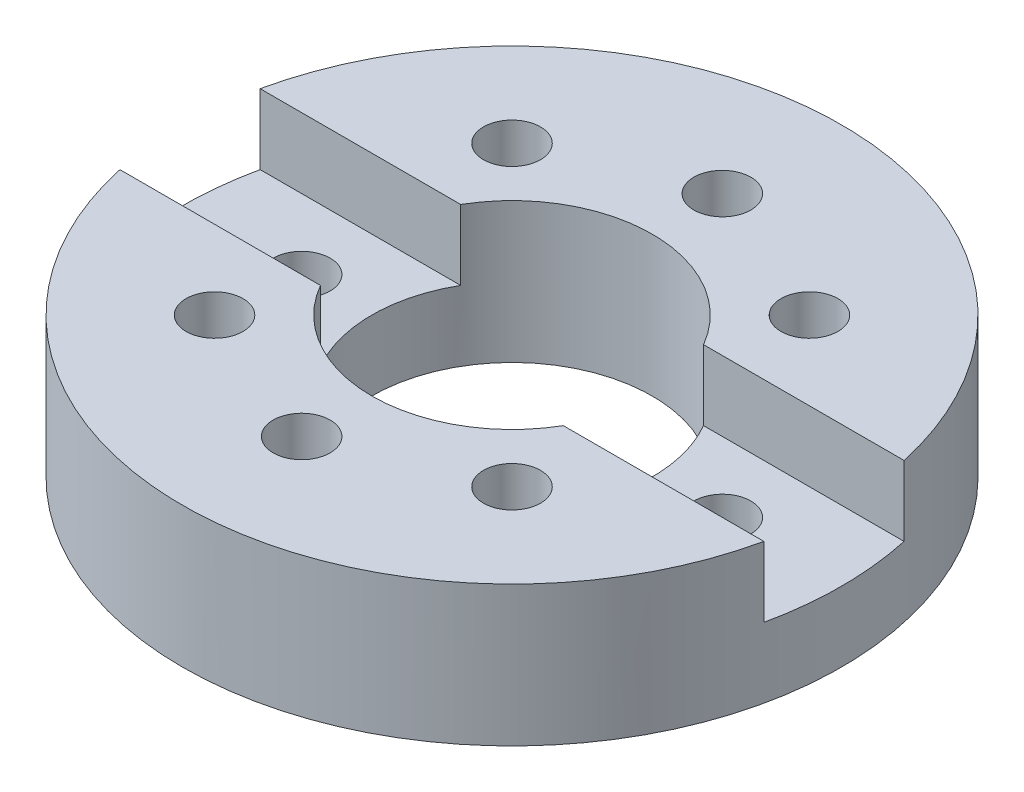
ISO-10303-21;
HEADER;
FILE_DESCRIPTION(('STEP AP214'),'2;1');
FILE_NAME('part.step','',(''),(''),'','','');
FILE_SCHEMA(('AUTOMOTIVE_DESIGN { 1 0 10303 214 1 1 1 1 }'));
ENDSEC;
DATA;
#1=APPLICATION_CONTEXT('core data for automotive mechanical design processes');
#2=APPLICATION_PROTOCOL_DEFINITION('international standard','automotive_design',2000,#1);
#3=PRODUCT_CONTEXT('',#1,'mechanical');
#4=PRODUCT('Part','Part','',(#3));
#5=PRODUCT_RELATED_PRODUCT_CATEGORY('part','',(#4));
#6=PRODUCT_DEFINITION_FORMATION('','',#4);
#7=PRODUCT_DEFINITION_CONTEXT('part definition',#1,'design');
#8=PRODUCT_DEFINITION('design','',#6,#7);
#9=PRODUCT_DEFINITION_SHAPE('','',#8);
#10=(LENGTH_UNIT() NAMED_UNIT(*) SI_UNIT(.MILLI.,.METRE.));
#11=(NAMED_UNIT(*) PLANE_ANGLE_UNIT() SI_UNIT($,.RADIAN.));
#12=(NAMED_UNIT(*) SI_UNIT($,.STERADIAN.) SOLID_ANGLE_UNIT());
#13=UNCERTAINTY_MEASURE_WITH_UNIT(LENGTH_MEASURE(1.E-05),#10,'distance_accuracy_value','');
#14=(GEOMETRIC_REPRESENTATION_CONTEXT(3) GLOBAL_UNCERTAINTY_ASSIGNED_CONTEXT((#13)) GLOBAL_UNIT_ASSIGNED_CONTEXT((#10,
#11,#12)) REPRESENTATION_CONTEXT('',''));
#15=CARTESIAN_POINT('',(0.,0.,0.));
#16=DIRECTION('',(0.,0.,1.));
#17=DIRECTION('',(1.,0.,0.));
#18=AXIS2_PLACEMENT_3D('',#15,#16,#17);
#19=CARTESIAN_POINT('',(0.,1.,0.));
#20=DIRECTION('',(0.,1.,0.));
#21=DIRECTION('',(0.,0.,1.));
#22=AXIS2_PLACEMENT_3D('',#19,#20,#21);
#23=PLANE('',#22);
#24=DIRECTION('',(-1.,0.,0.));
#25=VECTOR('',#24,1.);
#26=CARTESIAN_POINT('',(-2.35,1.,-0.5));
#27=LINE('',#26,#25);
#28=CARTESIAN_POINT('',(2.29619250064101,1.,-0.5));
#29=VERTEX_POINT('',#28);
#30=CARTESIAN_POINT('',(0.866025403784439,1.,-0.5));
#31=VERTEX_POINT('',#30);
#32=EDGE_CURVE('E217',#29,#31,#27,.T.);
#33=ORIENTED_EDGE('',*,*,#32,.F.);
#34=CARTESIAN_POINT('',(0.,1.,0.));
#35=DIRECTION('',(0.,1.,0.));
#36=DIRECTION('',(0.,0.,1.));
#37=AXIS2_PLACEMENT_3D('',#34,#35,#36);
#38=CIRCLE('',#37,2.35);
#39=CARTESIAN_POINT('',(-2.29619250064101,1.,-0.5));
#40=VERTEX_POINT('',#39);
#41=EDGE_CURVE('E189',#29,#40,#38,.T.);
#42=ORIENTED_EDGE('',*,*,#41,.T.);
#43=CARTESIAN_POINT('',(-0.866025403784439,1.,-0.5));
#44=VERTEX_POINT('',#43);
#45=EDGE_CURVE('E106',#44,#40,#27,.T.);
#46=ORIENTED_EDGE('',*,*,#45,.F.);
#47=CARTESIAN_POINT('',(0.,1.,0.));
#48=DIRECTION('',(0.,1.,0.));
#49=DIRECTION('',(0.,0.,1.));
#50=AXIS2_PLACEMENT_3D('',#47,#48,#49);
#51=CIRCLE('',#50,1.);
#52=EDGE_CURVE('E141',#31,#44,#51,.T.);
#53=ORIENTED_EDGE('',*,*,#52,.F.);
#54=EDGE_LOOP('',(#33,#42,#46,#53));
#55=FACE_BOUND('',#54,.T.);
#56=CARTESIAN_POINT('',(-1.06066017177982,1.,-1.06066017177982));
#57=DIRECTION('',(0.,1.,0.));
#58=DIRECTION('',(0.,0.,1.));
#59=AXIS2_PLACEMENT_3D('',#56,#57,#58);
#60=CIRCLE('',#59,0.2032);
#61=CARTESIAN_POINT('',(-1.06066017177982,1.,-0.857460171779821));
#62=VERTEX_POINT('',#61);
#63=EDGE_CURVE('E144',#62,#62,#60,.T.);
#64=ORIENTED_EDGE('',*,*,#63,.F.);
#65=EDGE_LOOP('',(#64));
#66=FACE_BOUND('',#65,.T.);
#67=CARTESIAN_POINT('',(1.06066017177982,1.,-1.06066017177982));
#68=DIRECTION('',(0.,1.,0.));
#69=DIRECTION('',(0.,0.,1.));
#70=AXIS2_PLACEMENT_3D('',#67,#68,#69);
#71=CIRCLE('',#70,0.2032);
#72=CARTESIAN_POINT('',(1.06066017177982,1.,-0.857460171779821));
#73=VERTEX_POINT('',#72);
#74=EDGE_CURVE('E174',#73,#73,#71,.T.);
#75=ORIENTED_EDGE('',*,*,#74,.F.);
#76=EDGE_LOOP('',(#75));
#77=FACE_BOUND('',#76,.T.);
#78=CARTESIAN_POINT('',(0.,1.,-1.5));
#79=DIRECTION('',(0.,1.,0.));
#80=DIRECTION('',(0.,0.,1.));
#81=AXIS2_PLACEMENT_3D('',#78,#79,#80);
#82=CIRCLE('',#81,0.2032);
#83=CARTESIAN_POINT('',(0.,1.,-1.2968));
#84=VERTEX_POINT('',#83);
#85=EDGE_CURVE('E180',#84,#84,#82,.T.);
#86=ORIENTED_EDGE('',*,*,#85,.F.);
#87=EDGE_LOOP('',(#86));
#88=FACE_BOUND('',#87,.T.);
#89=ADVANCED_FACE('F36',(#55,#66,#77,#88),#23,.T.);
#90=CARTESIAN_POINT('',(1.5,1.,0.));
#91=DIRECTION('',(0.,-1.,0.));
#92=DIRECTION('',(0.,0.,-1.));
#93=AXIS2_PLACEMENT_3D('',#90,#91,#92);
#94=CYLINDRICAL_SURFACE('',#93,0.2032);
#95=CARTESIAN_POINT('',(1.5,0.,0.));
#96=DIRECTION('',(0.,1.,0.));
#97=DIRECTION('',(0.,0.,1.));
#98=AXIS2_PLACEMENT_3D('',#95,#96,#97);
#99=CIRCLE('',#98,0.2032);
#100=CARTESIAN_POINT('',(1.5,0.,0.2032));
#101=VERTEX_POINT('',#100);
#102=EDGE_CURVE('E168',#101,#101,#99,.T.);
#103=ORIENTED_EDGE('',*,*,#102,.F.);
#104=EDGE_LOOP('',(#103));
#105=FACE_BOUND('',#104,.T.);
#106=CARTESIAN_POINT('',(1.5,0.5,0.));
#107=DIRECTION('',(0.,1.,0.));
#108=DIRECTION('',(0.,0.,1.));
#109=AXIS2_PLACEMENT_3D('',#106,#107,#108);
#110=CIRCLE('',#109,0.2032);
#111=CARTESIAN_POINT('',(1.5,0.5,0.2032));
#112=VERTEX_POINT('',#111);
#113=EDGE_CURVE('E123',#112,#112,#110,.T.);
#114=ORIENTED_EDGE('',*,*,#113,.T.);
#115=EDGE_LOOP('',(#114));
#116=FACE_BOUND('',#115,.T.);
#117=ADVANCED_FACE('F246',(#105,#116),#94,.F.);
#118=CARTESIAN_POINT('',(-1.5,1.,0.));
#119=DIRECTION('',(0.,-1.,0.));
#120=DIRECTION('',(0.,0.,-1.));
#121=AXIS2_PLACEMENT_3D('',#118,#119,#120);
#122=CYLINDRICAL_SURFACE('',#121,0.2032);
#123=CARTESIAN_POINT('',(-1.5,0.,0.));
#124=DIRECTION('',(0.,1.,0.));
#125=DIRECTION('',(0.,0.,1.));
#126=AXIS2_PLACEMENT_3D('',#123,#124,#125);
#127=CIRCLE('',#126,0.2032);
#128=CARTESIAN_POINT('',(-1.5,0.,0.2032));
#129=VERTEX_POINT('',#128);
#130=EDGE_CURVE('E147',#129,#129,#127,.T.);
#131=ORIENTED_EDGE('',*,*,#130,.F.);
#132=EDGE_LOOP('',(#131));
#133=FACE_BOUND('',#132,.T.);
#134=CARTESIAN_POINT('',(-1.5,0.5,0.));
#135=DIRECTION('',(0.,1.,0.));
#136=DIRECTION('',(0.,0.,1.));
#137=AXIS2_PLACEMENT_3D('',#134,#135,#136);
#138=CIRCLE('',#137,0.2032);
#139=CARTESIAN_POINT('',(-1.5,0.5,0.2032));
#140=VERTEX_POINT('',#139);
#141=EDGE_CURVE('E127',#140,#140,#138,.T.);
#142=ORIENTED_EDGE('',*,*,#141,.T.);
#143=EDGE_LOOP('',(#142));
#144=FACE_BOUND('',#143,.T.);
#145=ADVANCED_FACE('F252',(#133,#144),#122,.F.);
#146=DIRECTION('',(1.,0.,0.));
#147=VECTOR('',#146,1.);
#148=CARTESIAN_POINT('',(-2.35,1.,0.5));
#149=LINE('',#148,#147);
#150=CARTESIAN_POINT('',(-2.29619250064101,1.,0.5));
#151=VERTEX_POINT('',#150);
#152=CARTESIAN_POINT('',(-0.866025403784439,1.,0.5));
#153=VERTEX_POINT('',#152);
#154=EDGE_CURVE('E211',#151,#153,#149,.T.);
#155=ORIENTED_EDGE('',*,*,#154,.F.);
#156=CARTESIAN_POINT('',(2.29619250064101,1.,0.5));
#157=VERTEX_POINT('',#156);
#158=EDGE_CURVE('E186',#151,#157,#38,.T.);
#159=ORIENTED_EDGE('',*,*,#158,.T.);
#160=CARTESIAN_POINT('',(0.866025403784439,1.,0.5));
#161=VERTEX_POINT('',#160);
#162=EDGE_CURVE('E212',#161,#157,#149,.T.);
#163=ORIENTED_EDGE('',*,*,#162,.F.);
#164=EDGE_CURVE('E136',#153,#161,#51,.T.);
#165=ORIENTED_EDGE('',*,*,#164,.F.);
#166=EDGE_LOOP('',(#155,#159,#163,#165));
#167=FACE_BOUND('',#166,.T.);
#168=CARTESIAN_POINT('',(0.,1.,1.5));
#169=DIRECTION('',(0.,1.,0.));
#170=DIRECTION('',(0.,0.,1.));
#171=AXIS2_PLACEMENT_3D('',#168,#169,#170);
#172=CIRCLE('',#171,0.2032);
#173=CARTESIAN_POINT('',(0.,1.,1.7032));
#174=VERTEX_POINT('',#173);
#175=EDGE_CURVE('E159',#174,#174,#172,.T.);
#176=ORIENTED_EDGE('',*,*,#175,.F.);
#177=EDGE_LOOP('',(#176));
#178=FACE_BOUND('',#177,.T.);
#179=CARTESIAN_POINT('',(1.06066017177982,1.,1.06066017177982));
#180=DIRECTION('',(0.,1.,0.));
#181=DIRECTION('',(0.,0.,1.));
#182=AXIS2_PLACEMENT_3D('',#179,#180,#181);
#183=CIRCLE('',#182,0.2032);
#184=CARTESIAN_POINT('',(1.06066017177982,1.,1.26386017177982));
#185=VERTEX_POINT('',#184);
#186=EDGE_CURVE('E165',#185,#185,#183,.T.);
#187=ORIENTED_EDGE('',*,*,#186,.F.);
#188=EDGE_LOOP('',(#187));
#189=FACE_BOUND('',#188,.T.);
#190=CARTESIAN_POINT('',(-1.06066017177982,1.,1.06066017177982));
#191=DIRECTION('',(0.,1.,0.));
#192=DIRECTION('',(0.,0.,1.));
#193=AXIS2_PLACEMENT_3D('',#190,#191,#192);
#194=CIRCLE('',#193,0.2032);
#195=CARTESIAN_POINT('',(-1.06066017177982,1.,1.26386017177982));
#196=VERTEX_POINT('',#195);
#197=EDGE_CURVE('E153',#196,#196,#194,.T.);
#198=ORIENTED_EDGE('',*,*,#197,.F.);
#199=EDGE_LOOP('',(#198));
#200=FACE_BOUND('',#199,.T.);
#201=ADVANCED_FACE('F209',(#167,#178,#189,#200),#23,.T.);
#202=CARTESIAN_POINT('',(0.,0.,0.));
#203=DIRECTION('',(0.,1.,0.));
#204=DIRECTION('',(0.,0.,1.));
#205=AXIS2_PLACEMENT_3D('',#202,#203,#204);
#206=PLANE('',#205);
#207=CARTESIAN_POINT('',(0.,0.,0.));
#208=DIRECTION('',(0.,1.,0.));
#209=DIRECTION('',(0.,0.,1.));
#210=AXIS2_PLACEMENT_3D('',#207,#208,#209);
#211=CIRCLE('',#210,1.);
#212=CARTESIAN_POINT('',(0.,0.,1.));
#213=VERTEX_POINT('',#212);
#214=EDGE_CURVE('E137',#213,#213,#211,.T.);
#215=ORIENTED_EDGE('',*,*,#214,.T.);
#216=EDGE_LOOP('',(#215));
#217=FACE_BOUND('',#216,.T.);
#218=CARTESIAN_POINT('',(0.,0.,0.));
#219=DIRECTION('',(0.,1.,0.));
#220=DIRECTION('',(0.,0.,1.));
#221=AXIS2_PLACEMENT_3D('',#218,#219,#220);
#222=CIRCLE('',#221,2.35);
#223=CARTESIAN_POINT('',(0.,0.,2.35));
#224=VERTEX_POINT('',#223);
#225=EDGE_CURVE('E183',#224,#224,#222,.T.);
#226=ORIENTED_EDGE('',*,*,#225,.F.);
#227=EDGE_LOOP('',(#226));
#228=FACE_BOUND('',#227,.T.);
#229=CARTESIAN_POINT('',(0.,0.,-1.5));
#230=DIRECTION('',(0.,1.,0.));
#231=DIRECTION('',(0.,0.,1.));
#232=AXIS2_PLACEMENT_3D('',#229,#230,#231);
#233=CIRCLE('',#232,0.2032);
#234=CARTESIAN_POINT('',(0.,0.,-1.2968));
#235=VERTEX_POINT('',#234);
#236=EDGE_CURVE('E177',#235,#235,#233,.T.);
#237=ORIENTED_EDGE('',*,*,#236,.T.);
#238=EDGE_LOOP('',(#237));
#239=FACE_BOUND('',#238,.T.);
#240=CARTESIAN_POINT('',(1.06066017177982,0.,-1.06066017177982));
#241=DIRECTION('',(0.,1.,0.));
#242=DIRECTION('',(0.,0.,1.));
#243=AXIS2_PLACEMENT_3D('',#240,#241,#242);
#244=CIRCLE('',#243,0.2032);
#245=CARTESIAN_POINT('',(1.06066017177982,0.,-0.857460171779821));
#246=VERTEX_POINT('',#245);
#247=EDGE_CURVE('E173',#246,#246,#244,.T.);
#248=ORIENTED_EDGE('',*,*,#247,.T.);
#249=EDGE_LOOP('',(#248));
#250=FACE_BOUND('',#249,.T.);
#251=ORIENTED_EDGE('',*,*,#102,.T.);
#252=EDGE_LOOP('',(#251));
#253=FACE_BOUND('',#252,.T.);
#254=CARTESIAN_POINT('',(1.06066017177982,0.,1.06066017177982));
#255=DIRECTION('',(0.,1.,0.));
#256=DIRECTION('',(0.,0.,1.));
#257=AXIS2_PLACEMENT_3D('',#254,#255,#256);
#258=CIRCLE('',#257,0.2032);
#259=CARTESIAN_POINT('',(1.06066017177982,0.,1.26386017177982));
#260=VERTEX_POINT('',#259);
#261=EDGE_CURVE('E162',#260,#260,#258,.T.);
#262=ORIENTED_EDGE('',*,*,#261,.T.);
#263=EDGE_LOOP('',(#262));
#264=FACE_BOUND('',#263,.T.);
#265=CARTESIAN_POINT('',(0.,0.,1.5));
#266=DIRECTION('',(0.,1.,0.));
#267=DIRECTION('',(0.,0.,1.));
#268=AXIS2_PLACEMENT_3D('',#265,#266,#267);
#269=CIRCLE('',#268,0.2032);
#270=CARTESIAN_POINT('',(0.,0.,1.7032));
#271=VERTEX_POINT('',#270);
#272=EDGE_CURVE('E156',#271,#271,#269,.T.);
#273=ORIENTED_EDGE('',*,*,#272,.T.);
#274=EDGE_LOOP('',(#273));
#275=FACE_BOUND('',#274,.T.);
#276=CARTESIAN_POINT('',(-1.06066017177982,0.,1.06066017177982));
#277=DIRECTION('',(0.,1.,0.));
#278=DIRECTION('',(0.,0.,1.));
#279=AXIS2_PLACEMENT_3D('',#276,#277,#278);
#280=CIRCLE('',#279,0.2032);
#281=CARTESIAN_POINT('',(-1.06066017177982,0.,1.26386017177982));
#282=VERTEX_POINT('',#281);
#283=EDGE_CURVE('E152',#282,#282,#280,.T.);
#284=ORIENTED_EDGE('',*,*,#283,.T.);
#285=EDGE_LOOP('',(#284));
#286=FACE_BOUND('',#285,.T.);
#287=ORIENTED_EDGE('',*,*,#130,.T.);
#288=EDGE_LOOP('',(#287));
#289=FACE_BOUND('',#288,.T.);
#290=CARTESIAN_POINT('',(-1.06066017177982,0.,-1.06066017177982));
#291=DIRECTION('',(0.,1.,0.));
#292=DIRECTION('',(0.,0.,1.));
#293=AXIS2_PLACEMENT_3D('',#290,#291,#292);
#294=CIRCLE('',#293,0.2032);
#295=CARTESIAN_POINT('',(-1.06066017177982,0.,-0.857460171779821));
#296=VERTEX_POINT('',#295);
#297=EDGE_CURVE('E140',#296,#296,#294,.T.);
#298=ORIENTED_EDGE('',*,*,#297,.T.);
#299=EDGE_LOOP('',(#298));
#300=FACE_BOUND('',#299,.T.);
#301=ADVANCED_FACE('F259',(#217,#228,#239,#250,#253,#264,#275,#286,#289,#300),#206,.F.);
#302=CARTESIAN_POINT('',(0.,1.,0.));
#303=DIRECTION('',(0.,-1.,0.));
#304=DIRECTION('',(0.,0.,-1.));
#305=AXIS2_PLACEMENT_3D('',#302,#303,#304);
#306=CYLINDRICAL_SURFACE('',#305,2.35);
#307=ORIENTED_EDGE('',*,*,#41,.F.);
#308=DIRECTION('',(0.,-1.,0.));
#309=VECTOR('',#308,1.);
#310=CARTESIAN_POINT('',(2.29619250064101,1.,-0.5));
#311=LINE('',#310,#309);
#312=CARTESIAN_POINT('',(2.29619250064101,0.5,-0.5));
#313=VERTEX_POINT('',#312);
#314=EDGE_CURVE('E111',#29,#313,#311,.T.);
#315=ORIENTED_EDGE('',*,*,#314,.T.);
#316=CARTESIAN_POINT('',(0.,0.5,0.));
#317=DIRECTION('',(0.,1.,0.));
#318=DIRECTION('',(0.,0.,1.));
#319=AXIS2_PLACEMENT_3D('',#316,#317,#318);
#320=CIRCLE('',#319,2.35);
#321=CARTESIAN_POINT('',(2.29619250064101,0.5,0.5));
#322=VERTEX_POINT('',#321);
#323=EDGE_CURVE('E122',#322,#313,#320,.T.);
#324=ORIENTED_EDGE('',*,*,#323,.F.);
#325=DIRECTION('',(0.,-1.,0.));
#326=VECTOR('',#325,1.);
#327=CARTESIAN_POINT('',(2.29619250064101,1.,0.5));
#328=LINE('',#327,#326);
#329=EDGE_CURVE('E125',#322,#157,#328,.F.);
#330=ORIENTED_EDGE('',*,*,#329,.T.);
#331=ORIENTED_EDGE('',*,*,#158,.F.);
#332=DIRECTION('',(0.,-1.,0.));
#333=VECTOR('',#332,1.);
#334=CARTESIAN_POINT('',(-2.29619250064101,1.,0.5));
#335=LINE('',#334,#333);
#336=CARTESIAN_POINT('',(-2.29619250064101,0.5,0.5));
#337=VERTEX_POINT('',#336);
#338=EDGE_CURVE('E112',#151,#337,#335,.T.);
#339=ORIENTED_EDGE('',*,*,#338,.T.);
#340=CARTESIAN_POINT('',(-2.29619250064101,0.5,-0.5));
#341=VERTEX_POINT('',#340);
#342=EDGE_CURVE('E115',#341,#337,#320,.T.);
#343=ORIENTED_EDGE('',*,*,#342,.F.);
#344=DIRECTION('',(0.,-1.,0.));
#345=VECTOR('',#344,1.);
#346=CARTESIAN_POINT('',(-2.29619250064101,1.,-0.5));
#347=LINE('',#346,#345);
#348=EDGE_CURVE('E101',#341,#40,#347,.F.);
#349=ORIENTED_EDGE('',*,*,#348,.T.);
#350=EDGE_LOOP('',(#307,#315,#324,#330,#331,#339,#343,#349));
#351=FACE_BOUND('',#350,.T.);
#352=ORIENTED_EDGE('',*,*,#225,.T.);
#353=EDGE_LOOP('',(#352));
#354=FACE_BOUND('',#353,.T.);
#355=ADVANCED_FACE('F38',(#351,#354),#306,.T.);
#356=CARTESIAN_POINT('',(0.,1.,-1.5));
#357=DIRECTION('',(0.,-1.,0.));
#358=DIRECTION('',(0.,0.,-1.));
#359=AXIS2_PLACEMENT_3D('',#356,#357,#358);
#360=CYLINDRICAL_SURFACE('',#359,0.2032);
#361=ORIENTED_EDGE('',*,*,#85,.T.);
#362=EDGE_LOOP('',(#361));
#363=FACE_BOUND('',#362,.T.);
#364=ORIENTED_EDGE('',*,*,#236,.F.);
#365=EDGE_LOOP('',(#364));
#366=FACE_BOUND('',#365,.T.);
#367=ADVANCED_FACE('F286',(#363,#366),#360,.F.);
#368=CARTESIAN_POINT('',(1.06066017177982,1.,-1.06066017177982));
#369=DIRECTION('',(0.,-1.,0.));
#370=DIRECTION('',(0.,0.,-1.));
#371=AXIS2_PLACEMENT_3D('',#368,#369,#370);
#372=CYLINDRICAL_SURFACE('',#371,0.2032);
#373=ORIENTED_EDGE('',*,*,#74,.T.);
#374=EDGE_LOOP('',(#373));
#375=FACE_BOUND('',#374,.T.);
#376=ORIENTED_EDGE('',*,*,#247,.F.);
#377=EDGE_LOOP('',(#376));
#378=FACE_BOUND('',#377,.T.);
#379=ADVANCED_FACE('F282',(#375,#378),#372,.F.);
#380=CARTESIAN_POINT('',(1.06066017177982,1.,1.06066017177982));
#381=DIRECTION('',(0.,-1.,0.));
#382=DIRECTION('',(0.,0.,-1.));
#383=AXIS2_PLACEMENT_3D('',#380,#381,#382);
#384=CYLINDRICAL_SURFACE('',#383,0.2032);
#385=ORIENTED_EDGE('',*,*,#186,.T.);
#386=EDGE_LOOP('',(#385));
#387=FACE_BOUND('',#386,.T.);
#388=ORIENTED_EDGE('',*,*,#261,.F.);
#389=EDGE_LOOP('',(#388));
#390=FACE_BOUND('',#389,.T.);
#391=ADVANCED_FACE('F279',(#387,#390),#384,.F.);
#392=CARTESIAN_POINT('',(0.,1.,1.5));
#393=DIRECTION('',(0.,-1.,0.));
#394=DIRECTION('',(0.,0.,-1.));
#395=AXIS2_PLACEMENT_3D('',#392,#393,#394);
#396=CYLINDRICAL_SURFACE('',#395,0.2032);
#397=ORIENTED_EDGE('',*,*,#175,.T.);
#398=EDGE_LOOP('',(#397));
#399=FACE_BOUND('',#398,.T.);
#400=ORIENTED_EDGE('',*,*,#272,.F.);
#401=EDGE_LOOP('',(#400));
#402=FACE_BOUND('',#401,.T.);
#403=ADVANCED_FACE('F275',(#399,#402),#396,.F.);
#404=CARTESIAN_POINT('',(-1.06066017177982,1.,1.06066017177982));
#405=DIRECTION('',(0.,-1.,0.));
#406=DIRECTION('',(0.,0.,-1.));
#407=AXIS2_PLACEMENT_3D('',#404,#405,#406);
#408=CYLINDRICAL_SURFACE('',#407,0.2032);
#409=ORIENTED_EDGE('',*,*,#197,.T.);
#410=EDGE_LOOP('',(#409));
#411=FACE_BOUND('',#410,.T.);
#412=ORIENTED_EDGE('',*,*,#283,.F.);
#413=EDGE_LOOP('',(#412));
#414=FACE_BOUND('',#413,.T.);
#415=ADVANCED_FACE('F272',(#411,#414),#408,.F.);
#416=CARTESIAN_POINT('',(-1.06066017177982,1.,-1.06066017177982));
#417=DIRECTION('',(0.,-1.,0.));
#418=DIRECTION('',(0.,0.,-1.));
#419=AXIS2_PLACEMENT_3D('',#416,#417,#418);
#420=CYLINDRICAL_SURFACE('',#419,0.2032);
#421=ORIENTED_EDGE('',*,*,#63,.T.);
#422=EDGE_LOOP('',(#421));
#423=FACE_BOUND('',#422,.T.);
#424=ORIENTED_EDGE('',*,*,#297,.F.);
#425=EDGE_LOOP('',(#424));
#426=FACE_BOUND('',#425,.T.);
#427=ADVANCED_FACE('F239',(#423,#426),#420,.F.);
#428=CARTESIAN_POINT('',(0.,0.,0.));
#429=DIRECTION('',(0.,1.,0.));
#430=DIRECTION('',(0.,0.,1.));
#431=AXIS2_PLACEMENT_3D('',#428,#429,#430);
#432=CYLINDRICAL_SURFACE('',#431,1.);
#433=ORIENTED_EDGE('',*,*,#52,.T.);
#434=DIRECTION('',(0.,1.,0.));
#435=VECTOR('',#434,1.);
#436=CARTESIAN_POINT('',(-0.866025403784439,0.,-0.5));
#437=LINE('',#436,#435);
#438=CARTESIAN_POINT('',(-0.866025403784439,0.5,-0.5));
#439=VERTEX_POINT('',#438);
#440=EDGE_CURVE('E12',#44,#439,#437,.F.);
#441=ORIENTED_EDGE('',*,*,#440,.T.);
#442=CARTESIAN_POINT('',(0.,0.5,0.));
#443=DIRECTION('',(0.,1.,0.));
#444=DIRECTION('',(0.,0.,1.));
#445=AXIS2_PLACEMENT_3D('',#442,#443,#444);
#446=CIRCLE('',#445,1.);
#447=CARTESIAN_POINT('',(-0.866025403784439,0.5,0.5));
#448=VERTEX_POINT('',#447);
#449=EDGE_CURVE('E117',#448,#439,#446,.F.);
#450=ORIENTED_EDGE('',*,*,#449,.F.);
#451=DIRECTION('',(0.,1.,0.));
#452=VECTOR('',#451,1.);
#453=CARTESIAN_POINT('',(-0.866025403784439,0.,0.5));
#454=LINE('',#453,#452);
#455=EDGE_CURVE('E44',#448,#153,#454,.T.);
#456=ORIENTED_EDGE('',*,*,#455,.T.);
#457=ORIENTED_EDGE('',*,*,#164,.T.);
#458=DIRECTION('',(0.,1.,0.));
#459=VECTOR('',#458,1.);
#460=CARTESIAN_POINT('',(0.866025403784439,0.,0.5));
#461=LINE('',#460,#459);
#462=CARTESIAN_POINT('',(0.866025403784439,0.5,0.5));
#463=VERTEX_POINT('',#462);
#464=EDGE_CURVE('E194',#161,#463,#461,.F.);
#465=ORIENTED_EDGE('',*,*,#464,.T.);
#466=CARTESIAN_POINT('',(0.866025403784439,0.5,-0.5));
#467=VERTEX_POINT('',#466);
#468=EDGE_CURVE('E192',#467,#463,#446,.F.);
#469=ORIENTED_EDGE('',*,*,#468,.F.);
#470=DIRECTION('',(0.,1.,0.));
#471=VECTOR('',#470,1.);
#472=CARTESIAN_POINT('',(0.866025403784439,0.,-0.5));
#473=LINE('',#472,#471);
#474=EDGE_CURVE('E197',#467,#31,#473,.T.);
#475=ORIENTED_EDGE('',*,*,#474,.T.);
#476=EDGE_LOOP('',(#433,#441,#450,#456,#457,#465,#469,#475));
#477=FACE_BOUND('',#476,.T.);
#478=ORIENTED_EDGE('',*,*,#214,.F.);
#479=EDGE_LOOP('',(#478));
#480=FACE_BOUND('',#479,.T.);
#481=ADVANCED_FACE('F203',(#477,#480),#432,.F.);
#482=CARTESIAN_POINT('',(0.,0.5,0.));
#483=DIRECTION('',(0.,1.,0.));
#484=DIRECTION('',(0.,0.,1.));
#485=AXIS2_PLACEMENT_3D('',#482,#483,#484);
#486=PLANE('',#485);
#487=ORIENTED_EDGE('',*,*,#113,.F.);
#488=EDGE_LOOP('',(#487));
#489=FACE_BOUND('',#488,.T.);
#490=ORIENTED_EDGE('',*,*,#323,.T.);
#491=DIRECTION('',(1.,0.,0.));
#492=VECTOR('',#491,1.);
#493=CARTESIAN_POINT('',(-2.35,0.5,-0.5));
#494=LINE('',#493,#492);
#495=EDGE_CURVE('E59',#467,#313,#494,.T.);
#496=ORIENTED_EDGE('',*,*,#495,.F.);
#497=ORIENTED_EDGE('',*,*,#468,.T.);
#498=DIRECTION('',(-1.,0.,0.));
#499=VECTOR('',#498,1.);
#500=CARTESIAN_POINT('',(-2.35,0.5,0.5));
#501=LINE('',#500,#499);
#502=EDGE_CURVE('E218',#322,#463,#501,.T.);
#503=ORIENTED_EDGE('',*,*,#502,.F.);
#504=EDGE_LOOP('',(#490,#496,#497,#503));
#505=FACE_BOUND('',#504,.T.);
#506=ADVANCED_FACE('F228',(#489,#505),#486,.T.);
#507=CARTESIAN_POINT('',(-2.35,-5.78705451849211,0.5));
#508=DIRECTION('',(0.,0.,1.));
#509=DIRECTION('',(1.,0.,0.));
#510=AXIS2_PLACEMENT_3D('',#507,#508,#509);
#511=PLANE('',#510);
#512=ORIENTED_EDGE('',*,*,#502,.T.);
#513=ORIENTED_EDGE('',*,*,#464,.F.);
#514=ORIENTED_EDGE('',*,*,#162,.T.);
#515=ORIENTED_EDGE('',*,*,#329,.F.);
#516=EDGE_LOOP('',(#512,#513,#514,#515));
#517=FACE_BOUND('',#516,.T.);
#518=ADVANCED_FACE('F224',(#517),#511,.F.);
#519=CARTESIAN_POINT('',(-2.35,-5.78705451849211,-0.5));
#520=DIRECTION('',(0.,0.,-1.));
#521=DIRECTION('',(-1.,0.,0.));
#522=AXIS2_PLACEMENT_3D('',#519,#520,#521);
#523=PLANE('',#522);
#524=ORIENTED_EDGE('',*,*,#32,.T.);
#525=ORIENTED_EDGE('',*,*,#474,.F.);
#526=ORIENTED_EDGE('',*,*,#495,.T.);
#527=ORIENTED_EDGE('',*,*,#314,.F.);
#528=EDGE_LOOP('',(#524,#525,#526,#527));
#529=FACE_BOUND('',#528,.T.);
#530=ADVANCED_FACE('F236',(#529),#523,.F.);
#531=EDGE_CURVE('E104',#341,#439,#494,.T.);
#532=ORIENTED_EDGE('',*,*,#531,.T.);
#533=ORIENTED_EDGE('',*,*,#440,.F.);
#534=ORIENTED_EDGE('',*,*,#45,.T.);
#535=ORIENTED_EDGE('',*,*,#348,.F.);
#536=EDGE_LOOP('',(#532,#533,#534,#535));
#537=FACE_BOUND('',#536,.T.);
#538=ADVANCED_FACE('F103',(#537),#523,.F.);
#539=ORIENTED_EDGE('',*,*,#154,.T.);
#540=ORIENTED_EDGE('',*,*,#455,.F.);
#541=EDGE_CURVE('E51',#448,#337,#501,.T.);
#542=ORIENTED_EDGE('',*,*,#541,.T.);
#543=ORIENTED_EDGE('',*,*,#338,.F.);
#544=EDGE_LOOP('',(#539,#540,#542,#543));
#545=FACE_BOUND('',#544,.T.);
#546=ADVANCED_FACE('F238',(#545),#511,.F.);
#547=ORIENTED_EDGE('',*,*,#141,.F.);
#548=EDGE_LOOP('',(#547));
#549=FACE_BOUND('',#548,.T.);
#550=ORIENTED_EDGE('',*,*,#342,.T.);
#551=ORIENTED_EDGE('',*,*,#541,.F.);
#552=ORIENTED_EDGE('',*,*,#449,.T.);
#553=ORIENTED_EDGE('',*,*,#531,.F.);
#554=EDGE_LOOP('',(#550,#551,#552,#553));
#555=FACE_BOUND('',#554,.T.);
#556=ADVANCED_FACE('F114',(#549,#555),#486,.T.);
#557=CLOSED_SHELL('',(#89,#117,#145,#201,#301,#355,#367,#379,#391,#403,#415,#427,#481,#506,#518,
#530,#538,#546,#556));
#558=MANIFOLD_SOLID_BREP('B2',#557);
#559=ADVANCED_BREP_SHAPE_REPRESENTATION('',(#18,#558),#14);
#560=SHAPE_DEFINITION_REPRESENTATION(#9,#559);
ENDSEC;
END-ISO-10303-21;
